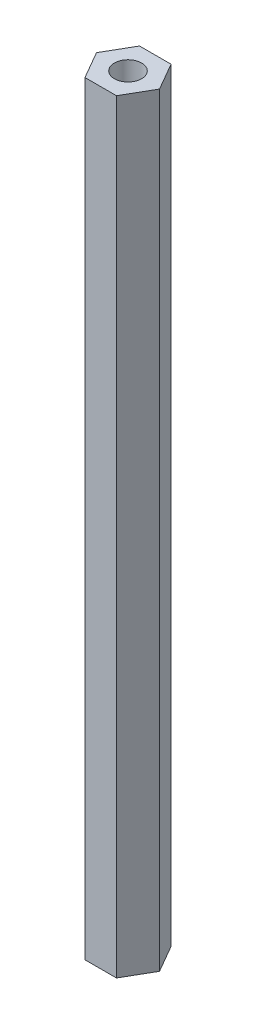
ISO-10303-21;
HEADER;
FILE_DESCRIPTION(('STEP AP214'),'2;1');
FILE_NAME('part.step','',(''),(''),'','','');
FILE_SCHEMA(('AUTOMOTIVE_DESIGN { 1 0 10303 214 1 1 1 1 }'));
ENDSEC;
DATA;
#1=APPLICATION_CONTEXT('core data for automotive mechanical design processes');
#2=APPLICATION_PROTOCOL_DEFINITION('international standard','automotive_design',2000,#1);
#3=PRODUCT_CONTEXT('',#1,'mechanical');
#4=PRODUCT('Part','Part','',(#3));
#5=PRODUCT_RELATED_PRODUCT_CATEGORY('part','',(#4));
#6=PRODUCT_DEFINITION_FORMATION('','',#4);
#7=PRODUCT_DEFINITION_CONTEXT('part definition',#1,'design');
#8=PRODUCT_DEFINITION('design','',#6,#7);
#9=PRODUCT_DEFINITION_SHAPE('','',#8);
#10=(LENGTH_UNIT() NAMED_UNIT(*) SI_UNIT(.MILLI.,.METRE.));
#11=(NAMED_UNIT(*) PLANE_ANGLE_UNIT() SI_UNIT($,.RADIAN.));
#12=(NAMED_UNIT(*) SI_UNIT($,.STERADIAN.) SOLID_ANGLE_UNIT());
#13=UNCERTAINTY_MEASURE_WITH_UNIT(LENGTH_MEASURE(1.E-05),#10,'distance_accuracy_value','');
#14=(GEOMETRIC_REPRESENTATION_CONTEXT(3) GLOBAL_UNCERTAINTY_ASSIGNED_CONTEXT((#13)) GLOBAL_UNIT_ASSIGNED_CONTEXT((#10,
#11,#12)) REPRESENTATION_CONTEXT('',''));
#15=CARTESIAN_POINT('',(0.,0.,0.));
#16=DIRECTION('',(0.,0.,1.));
#17=DIRECTION('',(1.,0.,0.));
#18=AXIS2_PLACEMENT_3D('',#15,#16,#17);
#19=CARTESIAN_POINT('',(0.,88.9,0.));
#20=DIRECTION('',(0.,1.,0.));
#21=DIRECTION('',(0.,0.,1.));
#22=AXIS2_PLACEMENT_3D('',#19,#20,#21);
#23=PLANE('',#22);
#24=DIRECTION('',(-0.5,0.,-0.866025403784439));
#25=VECTOR('',#24,1.);
#26=CARTESIAN_POINT('',(3.66617420935412,88.9,0.));
#27=LINE('',#26,#25);
#28=CARTESIAN_POINT('',(3.66617420935412,88.9,0.));
#29=VERTEX_POINT('',#28);
#30=CARTESIAN_POINT('',(1.83308710467706,88.9,-3.175));
#31=VERTEX_POINT('',#30);
#32=EDGE_CURVE('E146',#29,#31,#27,.T.);
#33=ORIENTED_EDGE('',*,*,#32,.T.);
#34=DIRECTION('',(-1.,0.,0.));
#35=VECTOR('',#34,1.);
#36=CARTESIAN_POINT('',(1.83308710467706,88.9,-3.175));
#37=LINE('',#36,#35);
#38=CARTESIAN_POINT('',(-1.83308710467706,88.9,-3.175));
#39=VERTEX_POINT('',#38);
#40=EDGE_CURVE('E94',#31,#39,#37,.T.);
#41=ORIENTED_EDGE('',*,*,#40,.T.);
#42=DIRECTION('',(-0.5,0.,0.866025403784438));
#43=VECTOR('',#42,1.);
#44=CARTESIAN_POINT('',(-1.83308710467706,88.9,-3.175));
#45=LINE('',#44,#43);
#46=CARTESIAN_POINT('',(-3.66617420935412,88.9,0.));
#47=VERTEX_POINT('',#46);
#48=EDGE_CURVE('E107',#39,#47,#45,.T.);
#49=ORIENTED_EDGE('',*,*,#48,.T.);
#50=DIRECTION('',(0.5,0.,0.866025403784439));
#51=VECTOR('',#50,1.);
#52=CARTESIAN_POINT('',(-3.66617420935412,88.9,0.));
#53=LINE('',#52,#51);
#54=CARTESIAN_POINT('',(-1.83308710467706,88.9,3.175));
#55=VERTEX_POINT('',#54);
#56=EDGE_CURVE('E101',#47,#55,#53,.T.);
#57=ORIENTED_EDGE('',*,*,#56,.T.);
#58=DIRECTION('',(1.,0.,0.));
#59=VECTOR('',#58,1.);
#60=CARTESIAN_POINT('',(-1.83308710467706,88.9,3.175));
#61=LINE('',#60,#59);
#62=CARTESIAN_POINT('',(1.83308710467706,88.9,3.175));
#63=VERTEX_POINT('',#62);
#64=EDGE_CURVE('E105',#55,#63,#61,.T.);
#65=ORIENTED_EDGE('',*,*,#64,.T.);
#66=DIRECTION('',(0.5,0.,-0.866025403784439));
#67=VECTOR('',#66,1.);
#68=CARTESIAN_POINT('',(1.83308710467706,88.9,3.175));
#69=LINE('',#68,#67);
#70=EDGE_CURVE('E57',#63,#29,#69,.T.);
#71=ORIENTED_EDGE('',*,*,#70,.T.);
#72=EDGE_LOOP('',(#33,#41,#49,#57,#65,#71));
#73=FACE_BOUND('',#72,.T.);
#74=CARTESIAN_POINT('',(0.,88.9,0.));
#75=DIRECTION('',(0.,1.,0.));
#76=DIRECTION('',(0.,0.,1.));
#77=AXIS2_PLACEMENT_3D('',#74,#75,#76);
#78=CIRCLE('',#77,1.5875);
#79=CARTESIAN_POINT('',(0.,88.9,1.5875));
#80=VERTEX_POINT('',#79);
#81=EDGE_CURVE('E134',#80,#80,#78,.T.);
#82=ORIENTED_EDGE('',*,*,#81,.F.);
#83=EDGE_LOOP('',(#82));
#84=FACE_BOUND('',#83,.T.);
#85=ADVANCED_FACE('F39',(#73,#84),#23,.T.);
#86=CARTESIAN_POINT('',(0.,0.,0.));
#87=DIRECTION('',(0.,1.,0.));
#88=DIRECTION('',(0.,0.,1.));
#89=AXIS2_PLACEMENT_3D('',#86,#87,#88);
#90=PLANE('',#89);
#91=DIRECTION('',(-0.5,0.,-0.866025403784439));
#92=VECTOR('',#91,1.);
#93=CARTESIAN_POINT('',(3.66617420935412,0.,0.));
#94=LINE('',#93,#92);
#95=CARTESIAN_POINT('',(3.66617420935412,0.,0.));
#96=VERTEX_POINT('',#95);
#97=CARTESIAN_POINT('',(1.83308710467706,0.,-3.175));
#98=VERTEX_POINT('',#97);
#99=EDGE_CURVE('E129',#96,#98,#94,.T.);
#100=ORIENTED_EDGE('',*,*,#99,.F.);
#101=DIRECTION('',(0.5,0.,-0.866025403784439));
#102=VECTOR('',#101,1.);
#103=CARTESIAN_POINT('',(1.83308710467706,0.,3.175));
#104=LINE('',#103,#102);
#105=CARTESIAN_POINT('',(1.83308710467706,0.,3.175));
#106=VERTEX_POINT('',#105);
#107=EDGE_CURVE('E86',#106,#96,#104,.T.);
#108=ORIENTED_EDGE('',*,*,#107,.F.);
#109=DIRECTION('',(1.,0.,0.));
#110=VECTOR('',#109,1.);
#111=CARTESIAN_POINT('',(-1.83308710467706,0.,3.175));
#112=LINE('',#111,#110);
#113=CARTESIAN_POINT('',(-1.83308710467706,0.,3.175));
#114=VERTEX_POINT('',#113);
#115=EDGE_CURVE('E80',#114,#106,#112,.T.);
#116=ORIENTED_EDGE('',*,*,#115,.F.);
#117=DIRECTION('',(0.5,0.,0.866025403784439));
#118=VECTOR('',#117,1.);
#119=CARTESIAN_POINT('',(-3.66617420935412,0.,0.));
#120=LINE('',#119,#118);
#121=CARTESIAN_POINT('',(-3.66617420935412,0.,0.));
#122=VERTEX_POINT('',#121);
#123=EDGE_CURVE('E116',#122,#114,#120,.T.);
#124=ORIENTED_EDGE('',*,*,#123,.F.);
#125=DIRECTION('',(-0.5,0.,0.866025403784438));
#126=VECTOR('',#125,1.);
#127=CARTESIAN_POINT('',(-1.83308710467706,0.,-3.175));
#128=LINE('',#127,#126);
#129=CARTESIAN_POINT('',(-1.83308710467706,0.,-3.175));
#130=VERTEX_POINT('',#129);
#131=EDGE_CURVE('E137',#130,#122,#128,.T.);
#132=ORIENTED_EDGE('',*,*,#131,.F.);
#133=DIRECTION('',(-1.,0.,0.));
#134=VECTOR('',#133,1.);
#135=CARTESIAN_POINT('',(1.83308710467706,0.,-3.175));
#136=LINE('',#135,#134);
#137=EDGE_CURVE('E133',#98,#130,#136,.T.);
#138=ORIENTED_EDGE('',*,*,#137,.F.);
#139=EDGE_LOOP('',(#100,#108,#116,#124,#132,#138));
#140=FACE_BOUND('',#139,.T.);
#141=CARTESIAN_POINT('',(0.,0.,0.));
#142=DIRECTION('',(0.,1.,0.));
#143=DIRECTION('',(0.,0.,1.));
#144=AXIS2_PLACEMENT_3D('',#141,#142,#143);
#145=CIRCLE('',#144,1.5875);
#146=CARTESIAN_POINT('',(0.,0.,1.5875));
#147=VERTEX_POINT('',#146);
#148=EDGE_CURVE('E243',#147,#147,#145,.T.);
#149=ORIENTED_EDGE('',*,*,#148,.T.);
#150=EDGE_LOOP('',(#149));
#151=FACE_BOUND('',#150,.T.);
#152=ADVANCED_FACE('F159',(#140,#151),#90,.F.);
#153=CARTESIAN_POINT('',(3.66617420935412,88.9,0.));
#154=DIRECTION('',(-0.866025403784439,0.,0.5));
#155=DIRECTION('',(0.5,0.,0.866025403784439));
#156=AXIS2_PLACEMENT_3D('',#153,#154,#155);
#157=PLANE('',#156);
#158=ORIENTED_EDGE('',*,*,#99,.T.);
#159=DIRECTION('',(0.,-1.,0.));
#160=VECTOR('',#159,1.);
#161=CARTESIAN_POINT('',(1.83308710467706,88.9,-3.175));
#162=LINE('',#161,#160);
#163=EDGE_CURVE('E11',#31,#98,#162,.T.);
#164=ORIENTED_EDGE('',*,*,#163,.F.);
#165=ORIENTED_EDGE('',*,*,#32,.F.);
#166=DIRECTION('',(0.,-1.,0.));
#167=VECTOR('',#166,1.);
#168=CARTESIAN_POINT('',(3.66617420935412,88.9,0.));
#169=LINE('',#168,#167);
#170=EDGE_CURVE('E125',#29,#96,#169,.T.);
#171=ORIENTED_EDGE('',*,*,#170,.T.);
#172=EDGE_LOOP('',(#158,#164,#165,#171));
#173=FACE_BOUND('',#172,.T.);
#174=ADVANCED_FACE('F41',(#173),#157,.F.);
#175=CARTESIAN_POINT('',(1.83308710467706,88.9,-3.175));
#176=DIRECTION('',(0.,0.,1.));
#177=DIRECTION('',(1.,0.,0.));
#178=AXIS2_PLACEMENT_3D('',#175,#176,#177);
#179=PLANE('',#178);
#180=ORIENTED_EDGE('',*,*,#137,.T.);
#181=DIRECTION('',(0.,-1.,0.));
#182=VECTOR('',#181,1.);
#183=CARTESIAN_POINT('',(-1.83308710467706,88.9,-3.175));
#184=LINE('',#183,#182);
#185=EDGE_CURVE('E49',#39,#130,#184,.T.);
#186=ORIENTED_EDGE('',*,*,#185,.F.);
#187=ORIENTED_EDGE('',*,*,#40,.F.);
#188=ORIENTED_EDGE('',*,*,#163,.T.);
#189=EDGE_LOOP('',(#180,#186,#187,#188));
#190=FACE_BOUND('',#189,.T.);
#191=ADVANCED_FACE('F184',(#190),#179,.F.);
#192=CARTESIAN_POINT('',(-1.83308710467706,88.9,-3.175));
#193=DIRECTION('',(0.866025403784438,0.,0.5));
#194=DIRECTION('',(0.5,0.,-0.866025403784439));
#195=AXIS2_PLACEMENT_3D('',#192,#193,#194);
#196=PLANE('',#195);
#197=ORIENTED_EDGE('',*,*,#131,.T.);
#198=DIRECTION('',(0.,-1.,0.));
#199=VECTOR('',#198,1.);
#200=CARTESIAN_POINT('',(-3.66617420935412,88.9,0.));
#201=LINE('',#200,#199);
#202=EDGE_CURVE('E118',#47,#122,#201,.T.);
#203=ORIENTED_EDGE('',*,*,#202,.F.);
#204=ORIENTED_EDGE('',*,*,#48,.F.);
#205=ORIENTED_EDGE('',*,*,#185,.T.);
#206=EDGE_LOOP('',(#197,#203,#204,#205));
#207=FACE_BOUND('',#206,.T.);
#208=ADVANCED_FACE('F156',(#207),#196,.F.);
#209=CARTESIAN_POINT('',(-3.66617420935412,88.9,0.));
#210=DIRECTION('',(0.866025403784439,0.,-0.5));
#211=DIRECTION('',(-0.5,0.,-0.866025403784439));
#212=AXIS2_PLACEMENT_3D('',#209,#210,#211);
#213=PLANE('',#212);
#214=ORIENTED_EDGE('',*,*,#123,.T.);
#215=DIRECTION('',(0.,-1.,0.));
#216=VECTOR('',#215,1.);
#217=CARTESIAN_POINT('',(-1.83308710467706,88.9,3.175));
#218=LINE('',#217,#216);
#219=EDGE_CURVE('E113',#55,#114,#218,.T.);
#220=ORIENTED_EDGE('',*,*,#219,.F.);
#221=ORIENTED_EDGE('',*,*,#56,.F.);
#222=ORIENTED_EDGE('',*,*,#202,.T.);
#223=EDGE_LOOP('',(#214,#220,#221,#222));
#224=FACE_BOUND('',#223,.T.);
#225=ADVANCED_FACE('F114',(#224),#213,.F.);
#226=CARTESIAN_POINT('',(-1.83308710467706,88.9,3.175));
#227=DIRECTION('',(0.,0.,-1.));
#228=DIRECTION('',(-1.,0.,0.));
#229=AXIS2_PLACEMENT_3D('',#226,#227,#228);
#230=PLANE('',#229);
#231=ORIENTED_EDGE('',*,*,#115,.T.);
#232=DIRECTION('',(0.,-1.,0.));
#233=VECTOR('',#232,1.);
#234=CARTESIAN_POINT('',(1.83308710467706,88.9,3.175));
#235=LINE('',#234,#233);
#236=EDGE_CURVE('E119',#63,#106,#235,.T.);
#237=ORIENTED_EDGE('',*,*,#236,.F.);
#238=ORIENTED_EDGE('',*,*,#64,.F.);
#239=ORIENTED_EDGE('',*,*,#219,.T.);
#240=EDGE_LOOP('',(#231,#237,#238,#239));
#241=FACE_BOUND('',#240,.T.);
#242=ADVANCED_FACE('F121',(#241),#230,.F.);
#243=CARTESIAN_POINT('',(1.83308710467706,88.9,3.175));
#244=DIRECTION('',(-0.866025403784438,0.,-0.5));
#245=DIRECTION('',(-0.5,0.,0.866025403784439));
#246=AXIS2_PLACEMENT_3D('',#243,#244,#245);
#247=PLANE('',#246);
#248=ORIENTED_EDGE('',*,*,#107,.T.);
#249=ORIENTED_EDGE('',*,*,#170,.F.);
#250=ORIENTED_EDGE('',*,*,#70,.F.);
#251=ORIENTED_EDGE('',*,*,#236,.T.);
#252=EDGE_LOOP('',(#248,#249,#250,#251));
#253=FACE_BOUND('',#252,.T.);
#254=ADVANCED_FACE('F164',(#253),#247,.F.);
#255=CARTESIAN_POINT('',(0.,88.9,0.));
#256=DIRECTION('',(0.,-1.,0.));
#257=DIRECTION('',(0.,0.,-1.));
#258=AXIS2_PLACEMENT_3D('',#255,#256,#257);
#259=CYLINDRICAL_SURFACE('',#258,1.5875);
#260=ORIENTED_EDGE('',*,*,#81,.T.);
#261=EDGE_LOOP('',(#260));
#262=FACE_BOUND('',#261,.T.);
#263=ORIENTED_EDGE('',*,*,#148,.F.);
#264=EDGE_LOOP('',(#263));
#265=FACE_BOUND('',#264,.T.);
#266=ADVANCED_FACE('F166',(#262,#265),#259,.F.);
#267=CLOSED_SHELL('',(#85,#152,#174,#191,#208,#225,#242,#254,#266));
#268=MANIFOLD_SOLID_BREP('B2',#267);
#269=ADVANCED_BREP_SHAPE_REPRESENTATION('',(#18,#268),#14);
#270=SHAPE_DEFINITION_REPRESENTATION(#9,#269);
ENDSEC;
END-ISO-10303-21;
